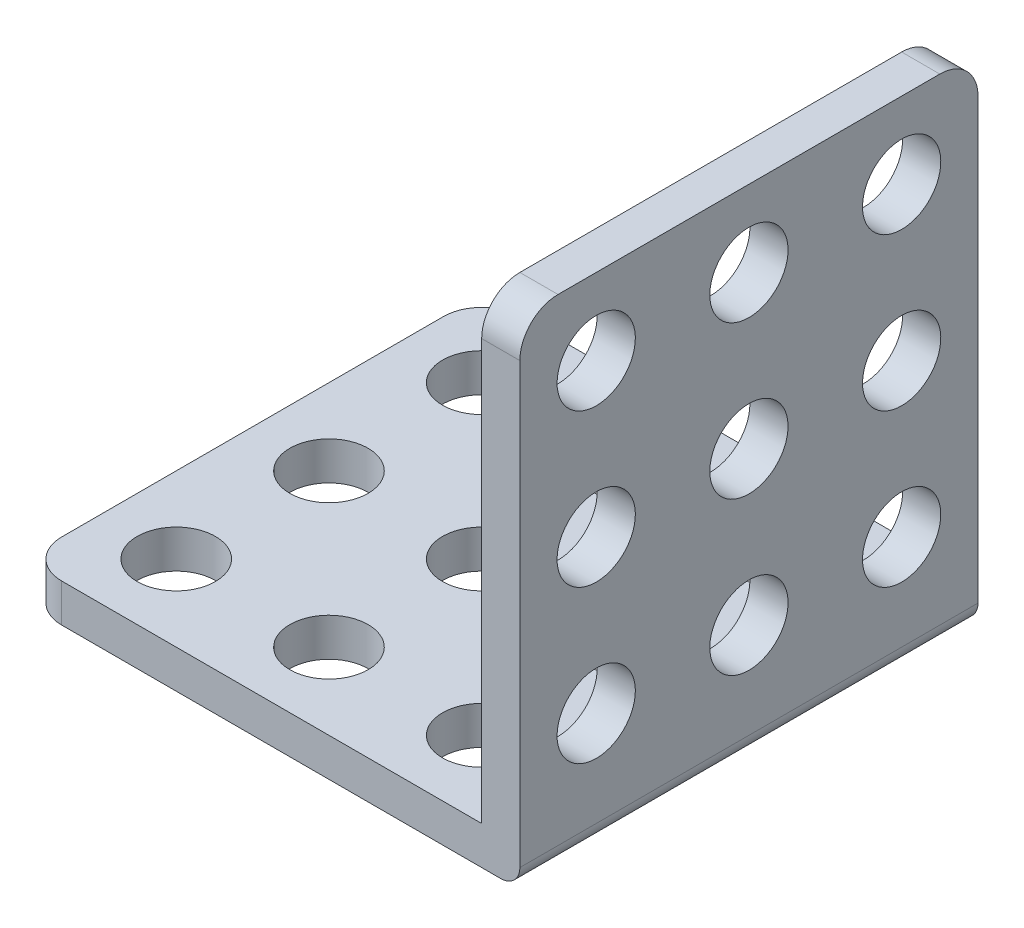
ISO-10303-21;
HEADER;
FILE_DESCRIPTION(('STEP AP214'),'2;1');
FILE_NAME('part.step','',(''),(''),'','','');
FILE_SCHEMA(('AUTOMOTIVE_DESIGN { 1 0 10303 214 1 1 1 1 }'));
ENDSEC;
DATA;
#1=APPLICATION_CONTEXT('core data for automotive mechanical design processes');
#2=APPLICATION_PROTOCOL_DEFINITION('international standard','automotive_design',2000,#1);
#3=PRODUCT_CONTEXT('',#1,'mechanical');
#4=PRODUCT('Part','Part','',(#3));
#5=PRODUCT_RELATED_PRODUCT_CATEGORY('part','',(#4));
#6=PRODUCT_DEFINITION_FORMATION('','',#4);
#7=PRODUCT_DEFINITION_CONTEXT('part definition',#1,'design');
#8=PRODUCT_DEFINITION('design','',#6,#7);
#9=PRODUCT_DEFINITION_SHAPE('','',#8);
#10=(LENGTH_UNIT() NAMED_UNIT(*) SI_UNIT(.MILLI.,.METRE.));
#11=(NAMED_UNIT(*) PLANE_ANGLE_UNIT() SI_UNIT($,.RADIAN.));
#12=(NAMED_UNIT(*) SI_UNIT($,.STERADIAN.) SOLID_ANGLE_UNIT());
#13=UNCERTAINTY_MEASURE_WITH_UNIT(LENGTH_MEASURE(1.E-05),#10,'distance_accuracy_value','');
#14=(GEOMETRIC_REPRESENTATION_CONTEXT(3) GLOBAL_UNCERTAINTY_ASSIGNED_CONTEXT((#13)) GLOBAL_UNIT_ASSIGNED_CONTEXT((#10,
#11,#12)) REPRESENTATION_CONTEXT('',''));
#15=CARTESIAN_POINT('',(0.,0.,0.));
#16=DIRECTION('',(0.,0.,1.));
#17=DIRECTION('',(1.,0.,0.));
#18=AXIS2_PLACEMENT_3D('',#15,#16,#17);
#19=CARTESIAN_POINT('',(2.,11.9999999999999,4.));
#20=DIRECTION('',(-1.,0.,0.));
#21=DIRECTION('',(0.,-1.,0.));
#22=AXIS2_PLACEMENT_3D('',#19,#20,#21);
#23=CYLINDRICAL_SURFACE('',#22,2.05);
#24=CARTESIAN_POINT('',(2.,11.9999999999999,4.));
#25=DIRECTION('',(-1.,0.,0.));
#26=DIRECTION('',(0.,-1.,0.));
#27=AXIS2_PLACEMENT_3D('',#24,#25,#26);
#28=CIRCLE('',#27,2.05);
#29=CARTESIAN_POINT('',(2.,9.9499999999999,4.));
#30=VERTEX_POINT('',#29);
#31=EDGE_CURVE('E145',#30,#30,#28,.F.);
#32=ORIENTED_EDGE('',*,*,#31,.T.);
#33=EDGE_LOOP('',(#32));
#34=FACE_BOUND('',#33,.T.);
#35=CARTESIAN_POINT('',(0.,11.9999999999999,4.));
#36=DIRECTION('',(-1.,0.,0.));
#37=DIRECTION('',(0.,-1.,0.));
#38=AXIS2_PLACEMENT_3D('',#35,#36,#37);
#39=CIRCLE('',#38,2.05);
#40=CARTESIAN_POINT('',(0.,9.9499999999999,4.));
#41=VERTEX_POINT('',#40);
#42=EDGE_CURVE('E20',#41,#41,#39,.T.);
#43=ORIENTED_EDGE('',*,*,#42,.T.);
#44=EDGE_LOOP('',(#43));
#45=FACE_BOUND('',#44,.T.);
#46=ADVANCED_FACE('F17',(#34,#45),#23,.F.);
#47=CARTESIAN_POINT('',(2.,19.9999999999999,4.));
#48=DIRECTION('',(-1.,0.,0.));
#49=DIRECTION('',(0.,-1.,0.));
#50=AXIS2_PLACEMENT_3D('',#47,#48,#49);
#51=CYLINDRICAL_SURFACE('',#50,2.05);
#52=CARTESIAN_POINT('',(2.,19.9999999999999,4.));
#53=DIRECTION('',(-1.,0.,0.));
#54=DIRECTION('',(0.,-1.,0.));
#55=AXIS2_PLACEMENT_3D('',#52,#53,#54);
#56=CIRCLE('',#55,2.05);
#57=CARTESIAN_POINT('',(2.,17.9499999999999,4.));
#58=VERTEX_POINT('',#57);
#59=EDGE_CURVE('E241',#58,#58,#56,.F.);
#60=ORIENTED_EDGE('',*,*,#59,.T.);
#61=EDGE_LOOP('',(#60));
#62=FACE_BOUND('',#61,.T.);
#63=CARTESIAN_POINT('',(0.,19.9999999999999,4.));
#64=DIRECTION('',(-1.,0.,0.));
#65=DIRECTION('',(0.,-1.,0.));
#66=AXIS2_PLACEMENT_3D('',#63,#64,#65);
#67=CIRCLE('',#66,2.05);
#68=CARTESIAN_POINT('',(0.,17.9499999999999,4.));
#69=VERTEX_POINT('',#68);
#70=EDGE_CURVE('E263',#69,#69,#67,.T.);
#71=ORIENTED_EDGE('',*,*,#70,.T.);
#72=EDGE_LOOP('',(#71));
#73=FACE_BOUND('',#72,.T.);
#74=ADVANCED_FACE('F380',(#62,#73),#51,.F.);
#75=CARTESIAN_POINT('',(2.,3.9999999999999,4.));
#76=DIRECTION('',(-1.,0.,0.));
#77=DIRECTION('',(0.,-1.,0.));
#78=AXIS2_PLACEMENT_3D('',#75,#76,#77);
#79=CYLINDRICAL_SURFACE('',#78,2.05);
#80=CARTESIAN_POINT('',(2.,3.9999999999999,4.));
#81=DIRECTION('',(-1.,0.,0.));
#82=DIRECTION('',(0.,-1.,0.));
#83=AXIS2_PLACEMENT_3D('',#80,#81,#82);
#84=CIRCLE('',#83,2.05);
#85=CARTESIAN_POINT('',(2.,1.9499999999999,4.));
#86=VERTEX_POINT('',#85);
#87=EDGE_CURVE('E238',#86,#86,#84,.F.);
#88=ORIENTED_EDGE('',*,*,#87,.T.);
#89=EDGE_LOOP('',(#88));
#90=FACE_BOUND('',#89,.T.);
#91=CARTESIAN_POINT('',(0.,3.9999999999999,4.));
#92=DIRECTION('',(-1.,0.,0.));
#93=DIRECTION('',(0.,-1.,0.));
#94=AXIS2_PLACEMENT_3D('',#91,#92,#93);
#95=CIRCLE('',#94,2.05);
#96=CARTESIAN_POINT('',(0.,1.9499999999999,4.));
#97=VERTEX_POINT('',#96);
#98=EDGE_CURVE('E261',#97,#97,#95,.T.);
#99=ORIENTED_EDGE('',*,*,#98,.T.);
#100=EDGE_LOOP('',(#99));
#101=FACE_BOUND('',#100,.T.);
#102=ADVANCED_FACE('F383',(#90,#101),#79,.F.);
#103=CARTESIAN_POINT('',(2.,11.9999999999999,12.));
#104=DIRECTION('',(-1.,0.,0.));
#105=DIRECTION('',(0.,-1.,0.));
#106=AXIS2_PLACEMENT_3D('',#103,#104,#105);
#107=CYLINDRICAL_SURFACE('',#106,2.05);
#108=CARTESIAN_POINT('',(2.,11.9999999999999,12.));
#109=DIRECTION('',(-1.,0.,0.));
#110=DIRECTION('',(0.,-1.,0.));
#111=AXIS2_PLACEMENT_3D('',#108,#109,#110);
#112=CIRCLE('',#111,2.05);
#113=CARTESIAN_POINT('',(2.,9.94999999999995,12.));
#114=VERTEX_POINT('',#113);
#115=EDGE_CURVE('E235',#114,#114,#112,.F.);
#116=ORIENTED_EDGE('',*,*,#115,.T.);
#117=EDGE_LOOP('',(#116));
#118=FACE_BOUND('',#117,.T.);
#119=CARTESIAN_POINT('',(0.,11.9999999999999,12.));
#120=DIRECTION('',(-1.,0.,0.));
#121=DIRECTION('',(0.,-1.,0.));
#122=AXIS2_PLACEMENT_3D('',#119,#120,#121);
#123=CIRCLE('',#122,2.05);
#124=CARTESIAN_POINT('',(0.,9.94999999999995,12.));
#125=VERTEX_POINT('',#124);
#126=EDGE_CURVE('E258',#125,#125,#123,.T.);
#127=ORIENTED_EDGE('',*,*,#126,.T.);
#128=EDGE_LOOP('',(#127));
#129=FACE_BOUND('',#128,.T.);
#130=ADVANCED_FACE('F388',(#118,#129),#107,.F.);
#131=CARTESIAN_POINT('',(2.,12.,20.));
#132=DIRECTION('',(-1.,0.,0.));
#133=DIRECTION('',(0.,-1.,0.));
#134=AXIS2_PLACEMENT_3D('',#131,#132,#133);
#135=CYLINDRICAL_SURFACE('',#134,2.05);
#136=CARTESIAN_POINT('',(2.,12.,20.));
#137=DIRECTION('',(-1.,0.,0.));
#138=DIRECTION('',(0.,-1.,0.));
#139=AXIS2_PLACEMENT_3D('',#136,#137,#138);
#140=CIRCLE('',#139,2.05);
#141=CARTESIAN_POINT('',(2.,9.95,20.));
#142=VERTEX_POINT('',#141);
#143=EDGE_CURVE('E232',#142,#142,#140,.F.);
#144=ORIENTED_EDGE('',*,*,#143,.T.);
#145=EDGE_LOOP('',(#144));
#146=FACE_BOUND('',#145,.T.);
#147=CARTESIAN_POINT('',(0.,12.,20.));
#148=DIRECTION('',(-1.,0.,0.));
#149=DIRECTION('',(0.,-1.,0.));
#150=AXIS2_PLACEMENT_3D('',#147,#148,#149);
#151=CIRCLE('',#150,2.05);
#152=CARTESIAN_POINT('',(0.,9.95,20.));
#153=VERTEX_POINT('',#152);
#154=EDGE_CURVE('E255',#153,#153,#151,.T.);
#155=ORIENTED_EDGE('',*,*,#154,.T.);
#156=EDGE_LOOP('',(#155));
#157=FACE_BOUND('',#156,.T.);
#158=ADVANCED_FACE('F394',(#146,#157),#135,.F.);
#159=CARTESIAN_POINT('',(2.,19.9999999999999,12.));
#160=DIRECTION('',(-1.,0.,0.));
#161=DIRECTION('',(0.,-1.,0.));
#162=AXIS2_PLACEMENT_3D('',#159,#160,#161);
#163=CYLINDRICAL_SURFACE('',#162,2.05);
#164=CARTESIAN_POINT('',(2.,19.9999999999999,12.));
#165=DIRECTION('',(-1.,0.,0.));
#166=DIRECTION('',(0.,-1.,0.));
#167=AXIS2_PLACEMENT_3D('',#164,#165,#166);
#168=CIRCLE('',#167,2.05);
#169=CARTESIAN_POINT('',(2.,17.9499999999999,12.));
#170=VERTEX_POINT('',#169);
#171=EDGE_CURVE('E229',#170,#170,#168,.F.);
#172=ORIENTED_EDGE('',*,*,#171,.T.);
#173=EDGE_LOOP('',(#172));
#174=FACE_BOUND('',#173,.T.);
#175=CARTESIAN_POINT('',(0.,19.9999999999999,12.));
#176=DIRECTION('',(-1.,0.,0.));
#177=DIRECTION('',(0.,-1.,0.));
#178=AXIS2_PLACEMENT_3D('',#175,#176,#177);
#179=CIRCLE('',#178,2.05);
#180=CARTESIAN_POINT('',(0.,17.9499999999999,12.));
#181=VERTEX_POINT('',#180);
#182=EDGE_CURVE('E252',#181,#181,#179,.T.);
#183=ORIENTED_EDGE('',*,*,#182,.T.);
#184=EDGE_LOOP('',(#183));
#185=FACE_BOUND('',#184,.T.);
#186=ADVANCED_FACE('F398',(#174,#185),#163,.F.);
#187=CARTESIAN_POINT('',(2.,20.,20.));
#188=DIRECTION('',(-1.,0.,0.));
#189=DIRECTION('',(0.,-1.,0.));
#190=AXIS2_PLACEMENT_3D('',#187,#188,#189);
#191=CYLINDRICAL_SURFACE('',#190,2.05);
#192=CARTESIAN_POINT('',(2.,20.,20.));
#193=DIRECTION('',(-1.,0.,0.));
#194=DIRECTION('',(0.,-1.,0.));
#195=AXIS2_PLACEMENT_3D('',#192,#193,#194);
#196=CIRCLE('',#195,2.05);
#197=CARTESIAN_POINT('',(2.,17.95,20.));
#198=VERTEX_POINT('',#197);
#199=EDGE_CURVE('E226',#198,#198,#196,.F.);
#200=ORIENTED_EDGE('',*,*,#199,.T.);
#201=EDGE_LOOP('',(#200));
#202=FACE_BOUND('',#201,.T.);
#203=CARTESIAN_POINT('',(0.,20.,20.));
#204=DIRECTION('',(-1.,0.,0.));
#205=DIRECTION('',(0.,-1.,0.));
#206=AXIS2_PLACEMENT_3D('',#203,#204,#205);
#207=CIRCLE('',#206,2.05);
#208=CARTESIAN_POINT('',(0.,17.95,20.));
#209=VERTEX_POINT('',#208);
#210=EDGE_CURVE('E249',#209,#209,#207,.T.);
#211=ORIENTED_EDGE('',*,*,#210,.T.);
#212=EDGE_LOOP('',(#211));
#213=FACE_BOUND('',#212,.T.);
#214=ADVANCED_FACE('F402',(#202,#213),#191,.F.);
#215=CARTESIAN_POINT('',(2.,4.,20.));
#216=DIRECTION('',(-1.,0.,0.));
#217=DIRECTION('',(0.,-1.,0.));
#218=AXIS2_PLACEMENT_3D('',#215,#216,#217);
#219=CYLINDRICAL_SURFACE('',#218,2.05);
#220=CARTESIAN_POINT('',(2.,4.,20.));
#221=DIRECTION('',(-1.,0.,0.));
#222=DIRECTION('',(0.,-1.,0.));
#223=AXIS2_PLACEMENT_3D('',#220,#221,#222);
#224=CIRCLE('',#223,2.05);
#225=CARTESIAN_POINT('',(2.,1.95,20.));
#226=VERTEX_POINT('',#225);
#227=EDGE_CURVE('E223',#226,#226,#224,.F.);
#228=ORIENTED_EDGE('',*,*,#227,.T.);
#229=EDGE_LOOP('',(#228));
#230=FACE_BOUND('',#229,.T.);
#231=CARTESIAN_POINT('',(0.,4.,20.));
#232=DIRECTION('',(-1.,0.,0.));
#233=DIRECTION('',(0.,-1.,0.));
#234=AXIS2_PLACEMENT_3D('',#231,#232,#233);
#235=CIRCLE('',#234,2.05);
#236=CARTESIAN_POINT('',(0.,1.95,20.));
#237=VERTEX_POINT('',#236);
#238=EDGE_CURVE('E124',#237,#237,#235,.T.);
#239=ORIENTED_EDGE('',*,*,#238,.T.);
#240=EDGE_LOOP('',(#239));
#241=FACE_BOUND('',#240,.T.);
#242=ADVANCED_FACE('F406',(#230,#241),#219,.F.);
#243=CARTESIAN_POINT('',(2.,3.99999999999995,12.));
#244=DIRECTION('',(-1.,0.,0.));
#245=DIRECTION('',(0.,-1.,0.));
#246=AXIS2_PLACEMENT_3D('',#243,#244,#245);
#247=CYLINDRICAL_SURFACE('',#246,2.05);
#248=CARTESIAN_POINT('',(2.,3.99999999999995,12.));
#249=DIRECTION('',(-1.,0.,0.));
#250=DIRECTION('',(0.,-1.,0.));
#251=AXIS2_PLACEMENT_3D('',#248,#249,#250);
#252=CIRCLE('',#251,2.05);
#253=CARTESIAN_POINT('',(2.,1.94999999999995,12.));
#254=VERTEX_POINT('',#253);
#255=EDGE_CURVE('E220',#254,#254,#252,.F.);
#256=ORIENTED_EDGE('',*,*,#255,.T.);
#257=EDGE_LOOP('',(#256));
#258=FACE_BOUND('',#257,.T.);
#259=CARTESIAN_POINT('',(0.,3.99999999999995,12.));
#260=DIRECTION('',(-1.,0.,0.));
#261=DIRECTION('',(0.,-1.,0.));
#262=AXIS2_PLACEMENT_3D('',#259,#260,#261);
#263=CIRCLE('',#262,2.05);
#264=CARTESIAN_POINT('',(0.,1.94999999999995,12.));
#265=VERTEX_POINT('',#264);
#266=EDGE_CURVE('E121',#265,#265,#263,.T.);
#267=ORIENTED_EDGE('',*,*,#266,.T.);
#268=EDGE_LOOP('',(#267));
#269=FACE_BOUND('',#268,.T.);
#270=ADVANCED_FACE('F410',(#258,#269),#247,.F.);
#271=CARTESIAN_POINT('',(0.,24.,24.));
#272=DIRECTION('',(0.,-1.,0.));
#273=DIRECTION('',(0.,0.,-1.));
#274=AXIS2_PLACEMENT_3D('',#271,#272,#273);
#275=PLANE('',#274);
#276=DIRECTION('',(-1.,0.,0.));
#277=VECTOR('',#276,1.);
#278=CARTESIAN_POINT('',(-24.,24.,22.));
#279=LINE('',#278,#277);
#280=CARTESIAN_POINT('',(2.,24.,22.));
#281=VERTEX_POINT('',#280);
#282=CARTESIAN_POINT('',(0.,24.,22.));
#283=VERTEX_POINT('',#282);
#284=EDGE_CURVE('E94',#281,#283,#279,.T.);
#285=ORIENTED_EDGE('',*,*,#284,.F.);
#286=DIRECTION('',(0.,0.,1.));
#287=VECTOR('',#286,1.);
#288=CARTESIAN_POINT('',(2.,24.,24.));
#289=LINE('',#288,#287);
#290=CARTESIAN_POINT('',(2.,24.,2.));
#291=VERTEX_POINT('',#290);
#292=EDGE_CURVE('E133',#281,#291,#289,.F.);
#293=ORIENTED_EDGE('',*,*,#292,.T.);
#294=DIRECTION('',(1.,0.,0.));
#295=VECTOR('',#294,1.);
#296=CARTESIAN_POINT('',(0.,24.,2.));
#297=LINE('',#296,#295);
#298=CARTESIAN_POINT('',(0.,24.,2.));
#299=VERTEX_POINT('',#298);
#300=EDGE_CURVE('E120',#299,#291,#297,.T.);
#301=ORIENTED_EDGE('',*,*,#300,.F.);
#302=DIRECTION('',(0.,0.,1.));
#303=VECTOR('',#302,1.);
#304=CARTESIAN_POINT('',(0.,24.,24.));
#305=LINE('',#304,#303);
#306=EDGE_CURVE('E111',#299,#283,#305,.T.);
#307=ORIENTED_EDGE('',*,*,#306,.T.);
#308=EDGE_LOOP('',(#285,#293,#301,#307));
#309=FACE_BOUND('',#308,.T.);
#310=ADVANCED_FACE('F119',(#309),#275,.F.);
#311=CARTESIAN_POINT('',(-24.,22.,22.));
#312=DIRECTION('',(-1.,0.,0.));
#313=DIRECTION('',(0.,0.,1.));
#314=AXIS2_PLACEMENT_3D('',#311,#312,#313);
#315=CYLINDRICAL_SURFACE('',#314,2.);
#316=CARTESIAN_POINT('',(0.,22.,22.));
#317=DIRECTION('',(-1.,0.,0.));
#318=DIRECTION('',(0.,0.,1.));
#319=AXIS2_PLACEMENT_3D('',#316,#317,#318);
#320=CIRCLE('',#319,2.);
#321=CARTESIAN_POINT('',(0.,22.,24.));
#322=VERTEX_POINT('',#321);
#323=EDGE_CURVE('E98',#283,#322,#320,.F.);
#324=ORIENTED_EDGE('',*,*,#323,.T.);
#325=DIRECTION('',(-1.,0.,0.));
#326=VECTOR('',#325,1.);
#327=CARTESIAN_POINT('',(-24.,22.,24.));
#328=LINE('',#327,#326);
#329=CARTESIAN_POINT('',(2.,22.,24.));
#330=VERTEX_POINT('',#329);
#331=EDGE_CURVE('E140',#322,#330,#328,.F.);
#332=ORIENTED_EDGE('',*,*,#331,.T.);
#333=CARTESIAN_POINT('',(2.,22.,22.));
#334=DIRECTION('',(-1.,0.,0.));
#335=DIRECTION('',(0.,0.,1.));
#336=AXIS2_PLACEMENT_3D('',#333,#334,#335);
#337=CIRCLE('',#336,2.);
#338=EDGE_CURVE('E100',#330,#281,#337,.T.);
#339=ORIENTED_EDGE('',*,*,#338,.T.);
#340=ORIENTED_EDGE('',*,*,#284,.T.);
#341=EDGE_LOOP('',(#324,#332,#339,#340));
#342=FACE_BOUND('',#341,.T.);
#343=ADVANCED_FACE('F96',(#342),#315,.T.);
#344=CARTESIAN_POINT('',(0.,0.,24.));
#345=DIRECTION('',(1.,0.,0.));
#346=DIRECTION('',(0.,1.,0.));
#347=AXIS2_PLACEMENT_3D('',#344,#345,#346);
#348=PLANE('',#347);
#349=ORIENTED_EDGE('',*,*,#323,.F.);
#350=ORIENTED_EDGE('',*,*,#306,.F.);
#351=CARTESIAN_POINT('',(0.,22.,2.));
#352=DIRECTION('',(1.,0.,0.));
#353=DIRECTION('',(0.,0.,-1.));
#354=AXIS2_PLACEMENT_3D('',#351,#352,#353);
#355=CIRCLE('',#354,2.);
#356=CARTESIAN_POINT('',(0.,22.,0.));
#357=VERTEX_POINT('',#356);
#358=EDGE_CURVE('E116',#357,#299,#355,.T.);
#359=ORIENTED_EDGE('',*,*,#358,.F.);
#360=DIRECTION('',(0.,1.,0.));
#361=VECTOR('',#360,1.);
#362=CARTESIAN_POINT('',(0.,0.,0.));
#363=LINE('',#362,#361);
#364=CARTESIAN_POINT('',(0.,0.,0.));
#365=VERTEX_POINT('',#364);
#366=EDGE_CURVE('E128',#365,#357,#363,.T.);
#367=ORIENTED_EDGE('',*,*,#366,.F.);
#368=DIRECTION('',(0.,0.,-1.));
#369=VECTOR('',#368,1.);
#370=CARTESIAN_POINT('',(0.,0.,24.));
#371=LINE('',#370,#369);
#372=CARTESIAN_POINT('',(0.,0.,24.));
#373=VERTEX_POINT('',#372);
#374=EDGE_CURVE('E130',#365,#373,#371,.F.);
#375=ORIENTED_EDGE('',*,*,#374,.T.);
#376=DIRECTION('',(0.,1.,0.));
#377=VECTOR('',#376,1.);
#378=CARTESIAN_POINT('',(0.,0.,24.));
#379=LINE('',#378,#377);
#380=EDGE_CURVE('E115',#373,#322,#379,.T.);
#381=ORIENTED_EDGE('',*,*,#380,.T.);
#382=EDGE_LOOP('',(#349,#350,#359,#367,#375,#381));
#383=FACE_BOUND('',#382,.T.);
#384=ORIENTED_EDGE('',*,*,#266,.F.);
#385=EDGE_LOOP('',(#384));
#386=FACE_BOUND('',#385,.T.);
#387=ORIENTED_EDGE('',*,*,#238,.F.);
#388=EDGE_LOOP('',(#387));
#389=FACE_BOUND('',#388,.T.);
#390=ORIENTED_EDGE('',*,*,#210,.F.);
#391=EDGE_LOOP('',(#390));
#392=FACE_BOUND('',#391,.T.);
#393=ORIENTED_EDGE('',*,*,#182,.F.);
#394=EDGE_LOOP('',(#393));
#395=FACE_BOUND('',#394,.T.);
#396=ORIENTED_EDGE('',*,*,#154,.F.);
#397=EDGE_LOOP('',(#396));
#398=FACE_BOUND('',#397,.T.);
#399=ORIENTED_EDGE('',*,*,#126,.F.);
#400=EDGE_LOOP('',(#399));
#401=FACE_BOUND('',#400,.T.);
#402=ORIENTED_EDGE('',*,*,#98,.F.);
#403=EDGE_LOOP('',(#402));
#404=FACE_BOUND('',#403,.T.);
#405=ORIENTED_EDGE('',*,*,#70,.F.);
#406=EDGE_LOOP('',(#405));
#407=FACE_BOUND('',#406,.T.);
#408=ORIENTED_EDGE('',*,*,#42,.F.);
#409=EDGE_LOOP('',(#408));
#410=FACE_BOUND('',#409,.T.);
#411=ADVANCED_FACE('F108',(#383,#386,#389,#392,#395,#398,#401,#404,#407,#410),#348,.F.);
#412=CARTESIAN_POINT('',(0.,22.,2.));
#413=DIRECTION('',(1.,0.,0.));
#414=DIRECTION('',(0.,0.,-1.));
#415=AXIS2_PLACEMENT_3D('',#412,#413,#414);
#416=CYLINDRICAL_SURFACE('',#415,2.);
#417=ORIENTED_EDGE('',*,*,#358,.T.);
#418=ORIENTED_EDGE('',*,*,#300,.T.);
#419=CARTESIAN_POINT('',(2.,22.,2.));
#420=DIRECTION('',(1.,0.,0.));
#421=DIRECTION('',(0.,0.,-1.));
#422=AXIS2_PLACEMENT_3D('',#419,#420,#421);
#423=CIRCLE('',#422,2.);
#424=CARTESIAN_POINT('',(2.,22.,0.));
#425=VERTEX_POINT('',#424);
#426=EDGE_CURVE('E217',#291,#425,#423,.F.);
#427=ORIENTED_EDGE('',*,*,#426,.T.);
#428=DIRECTION('',(-1.,0.,0.));
#429=VECTOR('',#428,1.);
#430=CARTESIAN_POINT('',(-24.,22.,0.));
#431=LINE('',#430,#429);
#432=EDGE_CURVE('E642',#357,#425,#431,.F.);
#433=ORIENTED_EDGE('',*,*,#432,.F.);
#434=EDGE_LOOP('',(#417,#418,#427,#433));
#435=FACE_BOUND('',#434,.T.);
#436=ADVANCED_FACE('F272',(#435),#416,.T.);
#437=CARTESIAN_POINT('',(2.,24.,24.));
#438=DIRECTION('',(-1.,0.,0.));
#439=DIRECTION('',(0.,-1.,0.));
#440=AXIS2_PLACEMENT_3D('',#437,#438,#439);
#441=PLANE('',#440);
#442=ORIENTED_EDGE('',*,*,#338,.F.);
#443=DIRECTION('',(0.,1.,0.));
#444=VECTOR('',#443,1.);
#445=CARTESIAN_POINT('',(2.,0.,24.));
#446=LINE('',#445,#444);
#447=CARTESIAN_POINT('',(2.,-0.999999999999997,24.));
#448=VERTEX_POINT('',#447);
#449=EDGE_CURVE('E142',#330,#448,#446,.F.);
#450=ORIENTED_EDGE('',*,*,#449,.T.);
#451=DIRECTION('',(0.,0.,-1.));
#452=VECTOR('',#451,1.);
#453=CARTESIAN_POINT('',(2.,-0.999999999999997,24.));
#454=LINE('',#453,#452);
#455=CARTESIAN_POINT('',(2.,-0.999999999999997,0.));
#456=VERTEX_POINT('',#455);
#457=EDGE_CURVE('E188',#456,#448,#454,.F.);
#458=ORIENTED_EDGE('',*,*,#457,.F.);
#459=DIRECTION('',(0.,1.,0.));
#460=VECTOR('',#459,1.);
#461=CARTESIAN_POINT('',(2.,0.,0.));
#462=LINE('',#461,#460);
#463=EDGE_CURVE('E186',#425,#456,#462,.F.);
#464=ORIENTED_EDGE('',*,*,#463,.F.);
#465=ORIENTED_EDGE('',*,*,#426,.F.);
#466=ORIENTED_EDGE('',*,*,#292,.F.);
#467=EDGE_LOOP('',(#442,#450,#458,#464,#465,#466));
#468=FACE_BOUND('',#467,.T.);
#469=ORIENTED_EDGE('',*,*,#255,.F.);
#470=EDGE_LOOP('',(#469));
#471=FACE_BOUND('',#470,.T.);
#472=ORIENTED_EDGE('',*,*,#227,.F.);
#473=EDGE_LOOP('',(#472));
#474=FACE_BOUND('',#473,.T.);
#475=ORIENTED_EDGE('',*,*,#199,.F.);
#476=EDGE_LOOP('',(#475));
#477=FACE_BOUND('',#476,.T.);
#478=ORIENTED_EDGE('',*,*,#171,.F.);
#479=EDGE_LOOP('',(#478));
#480=FACE_BOUND('',#479,.T.);
#481=ORIENTED_EDGE('',*,*,#143,.F.);
#482=EDGE_LOOP('',(#481));
#483=FACE_BOUND('',#482,.T.);
#484=ORIENTED_EDGE('',*,*,#115,.F.);
#485=EDGE_LOOP('',(#484));
#486=FACE_BOUND('',#485,.T.);
#487=ORIENTED_EDGE('',*,*,#87,.F.);
#488=EDGE_LOOP('',(#487));
#489=FACE_BOUND('',#488,.T.);
#490=ORIENTED_EDGE('',*,*,#59,.F.);
#491=EDGE_LOOP('',(#490));
#492=FACE_BOUND('',#491,.T.);
#493=ORIENTED_EDGE('',*,*,#31,.F.);
#494=EDGE_LOOP('',(#493));
#495=FACE_BOUND('',#494,.T.);
#496=ADVANCED_FACE('F279',(#468,#471,#474,#477,#480,#483,#486,#489,#492,#495),#441,.F.);
#497=CARTESIAN_POINT('',(-24.,0.,24.));
#498=DIRECTION('',(0.,-1.,0.));
#499=DIRECTION('',(0.,0.,-1.));
#500=AXIS2_PLACEMENT_3D('',#497,#498,#499);
#501=PLANE('',#500);
#502=CARTESIAN_POINT('',(-22.,0.,2.));
#503=DIRECTION('',(0.,1.,0.));
#504=DIRECTION('',(0.,0.,1.));
#505=AXIS2_PLACEMENT_3D('',#502,#503,#504);
#506=CIRCLE('',#505,2.);
#507=CARTESIAN_POINT('',(-24.,0.,2.));
#508=VERTEX_POINT('',#507);
#509=CARTESIAN_POINT('',(-22.,0.,0.));
#510=VERTEX_POINT('',#509);
#511=EDGE_CURVE('E181',#508,#510,#506,.F.);
#512=ORIENTED_EDGE('',*,*,#511,.F.);
#513=DIRECTION('',(0.,0.,-1.));
#514=VECTOR('',#513,1.);
#515=CARTESIAN_POINT('',(-24.,0.,24.));
#516=LINE('',#515,#514);
#517=CARTESIAN_POINT('',(-24.,0.,22.));
#518=VERTEX_POINT('',#517);
#519=EDGE_CURVE('E180',#508,#518,#516,.F.);
#520=ORIENTED_EDGE('',*,*,#519,.T.);
#521=CARTESIAN_POINT('',(-22.,0.,22.));
#522=DIRECTION('',(0.,-1.,0.));
#523=DIRECTION('',(0.,0.,-1.));
#524=AXIS2_PLACEMENT_3D('',#521,#522,#523);
#525=CIRCLE('',#524,2.);
#526=CARTESIAN_POINT('',(-22.,0.,24.));
#527=VERTEX_POINT('',#526);
#528=EDGE_CURVE('E141',#527,#518,#525,.T.);
#529=ORIENTED_EDGE('',*,*,#528,.F.);
#530=DIRECTION('',(-1.,0.,0.));
#531=VECTOR('',#530,1.);
#532=CARTESIAN_POINT('',(-24.,0.,24.));
#533=LINE('',#532,#531);
#534=EDGE_CURVE('E134',#527,#373,#533,.F.);
#535=ORIENTED_EDGE('',*,*,#534,.T.);
#536=ORIENTED_EDGE('',*,*,#374,.F.);
#537=DIRECTION('',(-1.,0.,0.));
#538=VECTOR('',#537,1.);
#539=CARTESIAN_POINT('',(-24.,0.,0.));
#540=LINE('',#539,#538);
#541=EDGE_CURVE('E638',#510,#365,#540,.F.);
#542=ORIENTED_EDGE('',*,*,#541,.F.);
#543=EDGE_LOOP('',(#512,#520,#529,#535,#536,#542));
#544=FACE_BOUND('',#543,.T.);
#545=CARTESIAN_POINT('',(-19.9999999999999,0.,12.));
#546=DIRECTION('',(0.,1.,0.));
#547=DIRECTION('',(0.,0.,1.));
#548=AXIS2_PLACEMENT_3D('',#545,#546,#547);
#549=CIRCLE('',#548,2.05);
#550=CARTESIAN_POINT('',(-19.9999999999999,0.,14.05));
#551=VERTEX_POINT('',#550);
#552=EDGE_CURVE('E190',#551,#551,#549,.F.);
#553=ORIENTED_EDGE('',*,*,#552,.T.);
#554=EDGE_LOOP('',(#553));
#555=FACE_BOUND('',#554,.T.);
#556=CARTESIAN_POINT('',(-20.,0.,4.));
#557=DIRECTION('',(0.,1.,0.));
#558=DIRECTION('',(0.,0.,1.));
#559=AXIS2_PLACEMENT_3D('',#556,#557,#558);
#560=CIRCLE('',#559,2.05);
#561=CARTESIAN_POINT('',(-20.,0.,6.05));
#562=VERTEX_POINT('',#561);
#563=EDGE_CURVE('E193',#562,#562,#560,.F.);
#564=ORIENTED_EDGE('',*,*,#563,.T.);
#565=EDGE_LOOP('',(#564));
#566=FACE_BOUND('',#565,.T.);
#567=CARTESIAN_POINT('',(-4.,0.,4.));
#568=DIRECTION('',(0.,1.,0.));
#569=DIRECTION('',(0.,0.,1.));
#570=AXIS2_PLACEMENT_3D('',#567,#568,#569);
#571=CIRCLE('',#570,2.05);
#572=CARTESIAN_POINT('',(-4.,0.,6.05));
#573=VERTEX_POINT('',#572);
#574=EDGE_CURVE('E196',#573,#573,#571,.F.);
#575=ORIENTED_EDGE('',*,*,#574,.T.);
#576=EDGE_LOOP('',(#575));
#577=FACE_BOUND('',#576,.T.);
#578=CARTESIAN_POINT('',(-12.,0.,4.));
#579=DIRECTION('',(0.,1.,0.));
#580=DIRECTION('',(0.,0.,1.));
#581=AXIS2_PLACEMENT_3D('',#578,#579,#580);
#582=CIRCLE('',#581,2.05);
#583=CARTESIAN_POINT('',(-12.,0.,6.05));
#584=VERTEX_POINT('',#583);
#585=EDGE_CURVE('E199',#584,#584,#582,.F.);
#586=ORIENTED_EDGE('',*,*,#585,.T.);
#587=EDGE_LOOP('',(#586));
#588=FACE_BOUND('',#587,.T.);
#589=CARTESIAN_POINT('',(-3.99999999999991,0.,12.));
#590=DIRECTION('',(0.,1.,0.));
#591=DIRECTION('',(0.,0.,1.));
#592=AXIS2_PLACEMENT_3D('',#589,#590,#591);
#593=CIRCLE('',#592,2.05);
#594=CARTESIAN_POINT('',(-3.99999999999991,0.,14.05));
#595=VERTEX_POINT('',#594);
#596=EDGE_CURVE('E202',#595,#595,#593,.F.);
#597=ORIENTED_EDGE('',*,*,#596,.T.);
#598=EDGE_LOOP('',(#597));
#599=FACE_BOUND('',#598,.T.);
#600=CARTESIAN_POINT('',(-11.9999999999999,0.,12.));
#601=DIRECTION('',(0.,1.,0.));
#602=DIRECTION('',(0.,0.,1.));
#603=AXIS2_PLACEMENT_3D('',#600,#601,#602);
#604=CIRCLE('',#603,2.05);
#605=CARTESIAN_POINT('',(-11.9999999999999,0.,14.05));
#606=VERTEX_POINT('',#605);
#607=EDGE_CURVE('E205',#606,#606,#604,.F.);
#608=ORIENTED_EDGE('',*,*,#607,.T.);
#609=EDGE_LOOP('',(#608));
#610=FACE_BOUND('',#609,.T.);
#611=CARTESIAN_POINT('',(-19.9999999999998,0.,20.));
#612=DIRECTION('',(0.,1.,0.));
#613=DIRECTION('',(0.,0.,1.));
#614=AXIS2_PLACEMENT_3D('',#611,#612,#613);
#615=CIRCLE('',#614,2.05);
#616=CARTESIAN_POINT('',(-19.9999999999998,0.,22.05));
#617=VERTEX_POINT('',#616);
#618=EDGE_CURVE('E208',#617,#617,#615,.F.);
#619=ORIENTED_EDGE('',*,*,#618,.T.);
#620=EDGE_LOOP('',(#619));
#621=FACE_BOUND('',#620,.T.);
#622=CARTESIAN_POINT('',(-3.99999999999983,0.,20.));
#623=DIRECTION('',(0.,1.,0.));
#624=DIRECTION('',(0.,0.,1.));
#625=AXIS2_PLACEMENT_3D('',#622,#623,#624);
#626=CIRCLE('',#625,2.05);
#627=CARTESIAN_POINT('',(-3.99999999999983,0.,22.05));
#628=VERTEX_POINT('',#627);
#629=EDGE_CURVE('E211',#628,#628,#626,.F.);
#630=ORIENTED_EDGE('',*,*,#629,.T.);
#631=EDGE_LOOP('',(#630));
#632=FACE_BOUND('',#631,.T.);
#633=CARTESIAN_POINT('',(-11.9999999999998,0.,20.));
#634=DIRECTION('',(0.,1.,0.));
#635=DIRECTION('',(0.,0.,1.));
#636=AXIS2_PLACEMENT_3D('',#633,#634,#635);
#637=CIRCLE('',#636,2.05);
#638=CARTESIAN_POINT('',(-11.9999999999998,0.,22.05));
#639=VERTEX_POINT('',#638);
#640=EDGE_CURVE('E132',#639,#639,#637,.F.);
#641=ORIENTED_EDGE('',*,*,#640,.T.);
#642=EDGE_LOOP('',(#641));
#643=FACE_BOUND('',#642,.T.);
#644=ADVANCED_FACE('F350',(#544,#555,#566,#577,#588,#599,#610,#621,#632,#643),#501,.F.);
#645=CARTESIAN_POINT('',(-11.9999999999998,-2.,20.));
#646=DIRECTION('',(0.,1.,0.));
#647=DIRECTION('',(0.,0.,1.));
#648=AXIS2_PLACEMENT_3D('',#645,#646,#647);
#649=CYLINDRICAL_SURFACE('',#648,2.05);
#650=CARTESIAN_POINT('',(-11.9999999999998,-2.,20.));
#651=DIRECTION('',(0.,1.,0.));
#652=DIRECTION('',(0.,0.,1.));
#653=AXIS2_PLACEMENT_3D('',#650,#651,#652);
#654=CIRCLE('',#653,2.05);
#655=CARTESIAN_POINT('',(-11.9999999999998,-2.,22.05));
#656=VERTEX_POINT('',#655);
#657=EDGE_CURVE('E177',#656,#656,#654,.F.);
#658=ORIENTED_EDGE('',*,*,#657,.T.);
#659=EDGE_LOOP('',(#658));
#660=FACE_BOUND('',#659,.T.);
#661=ORIENTED_EDGE('',*,*,#640,.F.);
#662=EDGE_LOOP('',(#661));
#663=FACE_BOUND('',#662,.T.);
#664=ADVANCED_FACE('F346',(#660,#663),#649,.F.);
#665=CARTESIAN_POINT('',(-3.99999999999983,-2.,20.));
#666=DIRECTION('',(0.,1.,0.));
#667=DIRECTION('',(0.,0.,1.));
#668=AXIS2_PLACEMENT_3D('',#665,#666,#667);
#669=CYLINDRICAL_SURFACE('',#668,2.05);
#670=CARTESIAN_POINT('',(-3.99999999999983,-2.,20.));
#671=DIRECTION('',(0.,1.,0.));
#672=DIRECTION('',(0.,0.,1.));
#673=AXIS2_PLACEMENT_3D('',#670,#671,#672);
#674=CIRCLE('',#673,2.05);
#675=CARTESIAN_POINT('',(-3.99999999999983,-2.,22.05));
#676=VERTEX_POINT('',#675);
#677=EDGE_CURVE('E174',#676,#676,#674,.F.);
#678=ORIENTED_EDGE('',*,*,#677,.T.);
#679=EDGE_LOOP('',(#678));
#680=FACE_BOUND('',#679,.T.);
#681=ORIENTED_EDGE('',*,*,#629,.F.);
#682=EDGE_LOOP('',(#681));
#683=FACE_BOUND('',#682,.T.);
#684=ADVANCED_FACE('F342',(#680,#683),#669,.F.);
#685=CARTESIAN_POINT('',(-19.9999999999998,-2.,20.));
#686=DIRECTION('',(0.,1.,0.));
#687=DIRECTION('',(0.,0.,1.));
#688=AXIS2_PLACEMENT_3D('',#685,#686,#687);
#689=CYLINDRICAL_SURFACE('',#688,2.05);
#690=CARTESIAN_POINT('',(-19.9999999999998,-2.,20.));
#691=DIRECTION('',(0.,1.,0.));
#692=DIRECTION('',(0.,0.,1.));
#693=AXIS2_PLACEMENT_3D('',#690,#691,#692);
#694=CIRCLE('',#693,2.05);
#695=CARTESIAN_POINT('',(-19.9999999999998,-2.,22.05));
#696=VERTEX_POINT('',#695);
#697=EDGE_CURVE('E171',#696,#696,#694,.F.);
#698=ORIENTED_EDGE('',*,*,#697,.T.);
#699=EDGE_LOOP('',(#698));
#700=FACE_BOUND('',#699,.T.);
#701=ORIENTED_EDGE('',*,*,#618,.F.);
#702=EDGE_LOOP('',(#701));
#703=FACE_BOUND('',#702,.T.);
#704=ADVANCED_FACE('F338',(#700,#703),#689,.F.);
#705=CARTESIAN_POINT('',(-11.9999999999999,-2.,12.));
#706=DIRECTION('',(0.,1.,0.));
#707=DIRECTION('',(0.,0.,1.));
#708=AXIS2_PLACEMENT_3D('',#705,#706,#707);
#709=CYLINDRICAL_SURFACE('',#708,2.05);
#710=CARTESIAN_POINT('',(-11.9999999999999,-2.,12.));
#711=DIRECTION('',(0.,1.,0.));
#712=DIRECTION('',(0.,0.,1.));
#713=AXIS2_PLACEMENT_3D('',#710,#711,#712);
#714=CIRCLE('',#713,2.05);
#715=CARTESIAN_POINT('',(-11.9999999999999,-2.,14.05));
#716=VERTEX_POINT('',#715);
#717=EDGE_CURVE('E168',#716,#716,#714,.F.);
#718=ORIENTED_EDGE('',*,*,#717,.T.);
#719=EDGE_LOOP('',(#718));
#720=FACE_BOUND('',#719,.T.);
#721=ORIENTED_EDGE('',*,*,#607,.F.);
#722=EDGE_LOOP('',(#721));
#723=FACE_BOUND('',#722,.T.);
#724=ADVANCED_FACE('F334',(#720,#723),#709,.F.);
#725=CARTESIAN_POINT('',(-3.99999999999991,-2.,12.));
#726=DIRECTION('',(0.,1.,0.));
#727=DIRECTION('',(0.,0.,1.));
#728=AXIS2_PLACEMENT_3D('',#725,#726,#727);
#729=CYLINDRICAL_SURFACE('',#728,2.05);
#730=CARTESIAN_POINT('',(-3.99999999999991,-2.,12.));
#731=DIRECTION('',(0.,1.,0.));
#732=DIRECTION('',(0.,0.,1.));
#733=AXIS2_PLACEMENT_3D('',#730,#731,#732);
#734=CIRCLE('',#733,2.05);
#735=CARTESIAN_POINT('',(-3.99999999999991,-2.,14.05));
#736=VERTEX_POINT('',#735);
#737=EDGE_CURVE('E165',#736,#736,#734,.F.);
#738=ORIENTED_EDGE('',*,*,#737,.T.);
#739=EDGE_LOOP('',(#738));
#740=FACE_BOUND('',#739,.T.);
#741=ORIENTED_EDGE('',*,*,#596,.F.);
#742=EDGE_LOOP('',(#741));
#743=FACE_BOUND('',#742,.T.);
#744=ADVANCED_FACE('F330',(#740,#743),#729,.F.);
#745=CARTESIAN_POINT('',(-12.,-2.,4.));
#746=DIRECTION('',(0.,1.,0.));
#747=DIRECTION('',(0.,0.,1.));
#748=AXIS2_PLACEMENT_3D('',#745,#746,#747);
#749=CYLINDRICAL_SURFACE('',#748,2.05);
#750=CARTESIAN_POINT('',(-12.,-2.,4.));
#751=DIRECTION('',(0.,1.,0.));
#752=DIRECTION('',(0.,0.,1.));
#753=AXIS2_PLACEMENT_3D('',#750,#751,#752);
#754=CIRCLE('',#753,2.05);
#755=CARTESIAN_POINT('',(-12.,-2.,6.05));
#756=VERTEX_POINT('',#755);
#757=EDGE_CURVE('E162',#756,#756,#754,.F.);
#758=ORIENTED_EDGE('',*,*,#757,.T.);
#759=EDGE_LOOP('',(#758));
#760=FACE_BOUND('',#759,.T.);
#761=ORIENTED_EDGE('',*,*,#585,.F.);
#762=EDGE_LOOP('',(#761));
#763=FACE_BOUND('',#762,.T.);
#764=ADVANCED_FACE('F326',(#760,#763),#749,.F.);
#765=CARTESIAN_POINT('',(-4.,-2.,4.));
#766=DIRECTION('',(0.,1.,0.));
#767=DIRECTION('',(0.,0.,1.));
#768=AXIS2_PLACEMENT_3D('',#765,#766,#767);
#769=CYLINDRICAL_SURFACE('',#768,2.05);
#770=CARTESIAN_POINT('',(-4.,-2.,4.));
#771=DIRECTION('',(0.,1.,0.));
#772=DIRECTION('',(0.,0.,1.));
#773=AXIS2_PLACEMENT_3D('',#770,#771,#772);
#774=CIRCLE('',#773,2.05);
#775=CARTESIAN_POINT('',(-4.,-2.,6.05));
#776=VERTEX_POINT('',#775);
#777=EDGE_CURVE('E159',#776,#776,#774,.F.);
#778=ORIENTED_EDGE('',*,*,#777,.T.);
#779=EDGE_LOOP('',(#778));
#780=FACE_BOUND('',#779,.T.);
#781=ORIENTED_EDGE('',*,*,#574,.F.);
#782=EDGE_LOOP('',(#781));
#783=FACE_BOUND('',#782,.T.);
#784=ADVANCED_FACE('F322',(#780,#783),#769,.F.);
#785=CARTESIAN_POINT('',(-20.,-2.,4.));
#786=DIRECTION('',(0.,1.,0.));
#787=DIRECTION('',(0.,0.,1.));
#788=AXIS2_PLACEMENT_3D('',#785,#786,#787);
#789=CYLINDRICAL_SURFACE('',#788,2.05);
#790=CARTESIAN_POINT('',(-20.,-2.,4.));
#791=DIRECTION('',(0.,1.,0.));
#792=DIRECTION('',(0.,0.,1.));
#793=AXIS2_PLACEMENT_3D('',#790,#791,#792);
#794=CIRCLE('',#793,2.05);
#795=CARTESIAN_POINT('',(-20.,-2.,6.05));
#796=VERTEX_POINT('',#795);
#797=EDGE_CURVE('E156',#796,#796,#794,.F.);
#798=ORIENTED_EDGE('',*,*,#797,.T.);
#799=EDGE_LOOP('',(#798));
#800=FACE_BOUND('',#799,.T.);
#801=ORIENTED_EDGE('',*,*,#563,.F.);
#802=EDGE_LOOP('',(#801));
#803=FACE_BOUND('',#802,.T.);
#804=ADVANCED_FACE('F318',(#800,#803),#789,.F.);
#805=CARTESIAN_POINT('',(-19.9999999999999,-2.,12.));
#806=DIRECTION('',(0.,1.,0.));
#807=DIRECTION('',(0.,0.,1.));
#808=AXIS2_PLACEMENT_3D('',#805,#806,#807);
#809=CYLINDRICAL_SURFACE('',#808,2.05);
#810=CARTESIAN_POINT('',(-19.9999999999999,-2.,12.));
#811=DIRECTION('',(0.,1.,0.));
#812=DIRECTION('',(0.,0.,1.));
#813=AXIS2_PLACEMENT_3D('',#810,#811,#812);
#814=CIRCLE('',#813,2.05);
#815=CARTESIAN_POINT('',(-19.9999999999999,-2.,14.05));
#816=VERTEX_POINT('',#815);
#817=EDGE_CURVE('E153',#816,#816,#814,.F.);
#818=ORIENTED_EDGE('',*,*,#817,.T.);
#819=EDGE_LOOP('',(#818));
#820=FACE_BOUND('',#819,.T.);
#821=ORIENTED_EDGE('',*,*,#552,.F.);
#822=EDGE_LOOP('',(#821));
#823=FACE_BOUND('',#822,.T.);
#824=ADVANCED_FACE('F314',(#820,#823),#809,.F.);
#825=CARTESIAN_POINT('',(-22.,0.,22.));
#826=DIRECTION('',(0.,-1.,0.));
#827=DIRECTION('',(0.,0.,-1.));
#828=AXIS2_PLACEMENT_3D('',#825,#826,#827);
#829=CYLINDRICAL_SURFACE('',#828,2.);
#830=CARTESIAN_POINT('',(-22.,-2.,22.));
#831=DIRECTION('',(0.,-1.,0.));
#832=DIRECTION('',(0.,0.,-1.));
#833=AXIS2_PLACEMENT_3D('',#830,#831,#832);
#834=CIRCLE('',#833,2.);
#835=CARTESIAN_POINT('',(-24.,-2.,22.));
#836=VERTEX_POINT('',#835);
#837=CARTESIAN_POINT('',(-22.,-2.,24.));
#838=VERTEX_POINT('',#837);
#839=EDGE_CURVE('E149',#836,#838,#834,.F.);
#840=ORIENTED_EDGE('',*,*,#839,.T.);
#841=DIRECTION('',(0.,1.,0.));
#842=VECTOR('',#841,1.);
#843=CARTESIAN_POINT('',(-22.,0.,24.));
#844=LINE('',#843,#842);
#845=EDGE_CURVE('E138',#838,#527,#844,.T.);
#846=ORIENTED_EDGE('',*,*,#845,.T.);
#847=ORIENTED_EDGE('',*,*,#528,.T.);
#848=DIRECTION('',(0.,1.,0.));
#849=VECTOR('',#848,1.);
#850=CARTESIAN_POINT('',(-24.,-2.,22.));
#851=LINE('',#850,#849);
#852=EDGE_CURVE('E658',#518,#836,#851,.F.);
#853=ORIENTED_EDGE('',*,*,#852,.T.);
#854=EDGE_LOOP('',(#840,#846,#847,#853));
#855=FACE_BOUND('',#854,.T.);
#856=ADVANCED_FACE('F310',(#855),#829,.T.);
#857=CARTESIAN_POINT('',(-24.,0.,24.));
#858=DIRECTION('',(0.,0.,-1.));
#859=DIRECTION('',(-1.,0.,0.));
#860=AXIS2_PLACEMENT_3D('',#857,#858,#859);
#861=PLANE('',#860);
#862=ORIENTED_EDGE('',*,*,#845,.F.);
#863=DIRECTION('',(-1.,0.,0.));
#864=VECTOR('',#863,1.);
#865=CARTESIAN_POINT('',(2.,-2.,24.));
#866=LINE('',#865,#864);
#867=CARTESIAN_POINT('',(1.,-2.,24.));
#868=VERTEX_POINT('',#867);
#869=EDGE_CURVE('E152',#838,#868,#866,.F.);
#870=ORIENTED_EDGE('',*,*,#869,.T.);
#871=CARTESIAN_POINT('',(1.,-0.999999999999997,24.));
#872=DIRECTION('',(0.,0.,-1.));
#873=DIRECTION('',(-1.,0.,0.));
#874=AXIS2_PLACEMENT_3D('',#871,#872,#873);
#875=CIRCLE('',#874,1.);
#876=EDGE_CURVE('E137',#448,#868,#875,.T.);
#877=ORIENTED_EDGE('',*,*,#876,.F.);
#878=ORIENTED_EDGE('',*,*,#449,.F.);
#879=ORIENTED_EDGE('',*,*,#331,.F.);
#880=ORIENTED_EDGE('',*,*,#380,.F.);
#881=ORIENTED_EDGE('',*,*,#534,.F.);
#882=EDGE_LOOP('',(#862,#870,#877,#878,#879,#880,#881));
#883=FACE_BOUND('',#882,.T.);
#884=ADVANCED_FACE('F306',(#883),#861,.F.);
#885=CARTESIAN_POINT('',(1.,-0.999999999999997,24.));
#886=DIRECTION('',(0.,0.,-1.));
#887=DIRECTION('',(-1.,0.,0.));
#888=AXIS2_PLACEMENT_3D('',#885,#886,#887);
#889=CYLINDRICAL_SURFACE('',#888,1.);
#890=CARTESIAN_POINT('',(1.,-0.999999999999997,0.));
#891=DIRECTION('',(0.,0.,-1.));
#892=DIRECTION('',(-1.,0.,0.));
#893=AXIS2_PLACEMENT_3D('',#890,#891,#892);
#894=CIRCLE('',#893,1.);
#895=CARTESIAN_POINT('',(1.,-2.,0.));
#896=VERTEX_POINT('',#895);
#897=EDGE_CURVE('E184',#456,#896,#894,.T.);
#898=ORIENTED_EDGE('',*,*,#897,.F.);
#899=ORIENTED_EDGE('',*,*,#457,.T.);
#900=ORIENTED_EDGE('',*,*,#876,.T.);
#901=DIRECTION('',(0.,0.,1.));
#902=VECTOR('',#901,1.);
#903=CARTESIAN_POINT('',(1.,-2.,24.));
#904=LINE('',#903,#902);
#905=EDGE_CURVE('E633',#868,#896,#904,.F.);
#906=ORIENTED_EDGE('',*,*,#905,.T.);
#907=EDGE_LOOP('',(#898,#899,#900,#906));
#908=FACE_BOUND('',#907,.T.);
#909=ADVANCED_FACE('F302',(#908),#889,.T.);
#910=CARTESIAN_POINT('',(-24.,0.,0.));
#911=DIRECTION('',(0.,0.,-1.));
#912=DIRECTION('',(-1.,0.,0.));
#913=AXIS2_PLACEMENT_3D('',#910,#911,#912);
#914=PLANE('',#913);
#915=ORIENTED_EDGE('',*,*,#463,.T.);
#916=ORIENTED_EDGE('',*,*,#897,.T.);
#917=DIRECTION('',(-1.,0.,0.));
#918=VECTOR('',#917,1.);
#919=CARTESIAN_POINT('',(2.,-2.,0.));
#920=LINE('',#919,#918);
#921=CARTESIAN_POINT('',(-22.,-2.,0.));
#922=VERTEX_POINT('',#921);
#923=EDGE_CURVE('E148',#896,#922,#920,.T.);
#924=ORIENTED_EDGE('',*,*,#923,.T.);
#925=DIRECTION('',(0.,1.,0.));
#926=VECTOR('',#925,1.);
#927=CARTESIAN_POINT('',(-22.,-2.,0.));
#928=LINE('',#927,#926);
#929=EDGE_CURVE('E183',#510,#922,#928,.F.);
#930=ORIENTED_EDGE('',*,*,#929,.F.);
#931=ORIENTED_EDGE('',*,*,#541,.T.);
#932=ORIENTED_EDGE('',*,*,#366,.T.);
#933=ORIENTED_EDGE('',*,*,#432,.T.);
#934=EDGE_LOOP('',(#915,#916,#924,#930,#931,#932,#933));
#935=FACE_BOUND('',#934,.T.);
#936=ADVANCED_FACE('F298',(#935),#914,.T.);
#937=CARTESIAN_POINT('',(-22.,-2.,2.));
#938=DIRECTION('',(0.,1.,0.));
#939=DIRECTION('',(0.,0.,1.));
#940=AXIS2_PLACEMENT_3D('',#937,#938,#939);
#941=CYLINDRICAL_SURFACE('',#940,2.);
#942=CARTESIAN_POINT('',(-22.,-2.,2.));
#943=DIRECTION('',(0.,1.,0.));
#944=DIRECTION('',(0.,0.,1.));
#945=AXIS2_PLACEMENT_3D('',#942,#943,#944);
#946=CIRCLE('',#945,2.);
#947=CARTESIAN_POINT('',(-24.,-2.,2.));
#948=VERTEX_POINT('',#947);
#949=EDGE_CURVE('E26',#922,#948,#946,.T.);
#950=ORIENTED_EDGE('',*,*,#949,.T.);
#951=DIRECTION('',(0.,1.,0.));
#952=VECTOR('',#951,1.);
#953=CARTESIAN_POINT('',(-24.,-2.,2.));
#954=LINE('',#953,#952);
#955=EDGE_CURVE('E34',#948,#508,#954,.T.);
#956=ORIENTED_EDGE('',*,*,#955,.T.);
#957=ORIENTED_EDGE('',*,*,#511,.T.);
#958=ORIENTED_EDGE('',*,*,#929,.T.);
#959=EDGE_LOOP('',(#950,#956,#957,#958));
#960=FACE_BOUND('',#959,.T.);
#961=ADVANCED_FACE('F291',(#960),#941,.T.);
#962=CARTESIAN_POINT('',(-24.,-2.,24.));
#963=DIRECTION('',(1.,0.,0.));
#964=DIRECTION('',(0.,0.,-1.));
#965=AXIS2_PLACEMENT_3D('',#962,#963,#964);
#966=PLANE('',#965);
#967=ORIENTED_EDGE('',*,*,#955,.F.);
#968=DIRECTION('',(0.,0.,1.));
#969=VECTOR('',#968,1.);
#970=CARTESIAN_POINT('',(-24.,-2.,24.));
#971=LINE('',#970,#969);
#972=EDGE_CURVE('E10',#948,#836,#971,.T.);
#973=ORIENTED_EDGE('',*,*,#972,.T.);
#974=ORIENTED_EDGE('',*,*,#852,.F.);
#975=ORIENTED_EDGE('',*,*,#519,.F.);
#976=EDGE_LOOP('',(#967,#973,#974,#975));
#977=FACE_BOUND('',#976,.T.);
#978=ADVANCED_FACE('F285',(#977),#966,.F.);
#979=CARTESIAN_POINT('',(2.,-2.,24.));
#980=DIRECTION('',(0.,1.,0.));
#981=DIRECTION('',(-1.,0.,0.));
#982=AXIS2_PLACEMENT_3D('',#979,#980,#981);
#983=PLANE('',#982);
#984=ORIENTED_EDGE('',*,*,#949,.F.);
#985=ORIENTED_EDGE('',*,*,#923,.F.);
#986=ORIENTED_EDGE('',*,*,#905,.F.);
#987=ORIENTED_EDGE('',*,*,#869,.F.);
#988=ORIENTED_EDGE('',*,*,#839,.F.);
#989=ORIENTED_EDGE('',*,*,#972,.F.);
#990=EDGE_LOOP('',(#984,#985,#986,#987,#988,#989));
#991=FACE_BOUND('',#990,.T.);
#992=ORIENTED_EDGE('',*,*,#817,.F.);
#993=EDGE_LOOP('',(#992));
#994=FACE_BOUND('',#993,.T.);
#995=ORIENTED_EDGE('',*,*,#797,.F.);
#996=EDGE_LOOP('',(#995));
#997=FACE_BOUND('',#996,.T.);
#998=ORIENTED_EDGE('',*,*,#777,.F.);
#999=EDGE_LOOP('',(#998));
#1000=FACE_BOUND('',#999,.T.);
#1001=ORIENTED_EDGE('',*,*,#757,.F.);
#1002=EDGE_LOOP('',(#1001));
#1003=FACE_BOUND('',#1002,.T.);
#1004=ORIENTED_EDGE('',*,*,#737,.F.);
#1005=EDGE_LOOP('',(#1004));
#1006=FACE_BOUND('',#1005,.T.);
#1007=ORIENTED_EDGE('',*,*,#717,.F.);
#1008=EDGE_LOOP('',(#1007));
#1009=FACE_BOUND('',#1008,.T.);
#1010=ORIENTED_EDGE('',*,*,#697,.F.);
#1011=EDGE_LOOP('',(#1010));
#1012=FACE_BOUND('',#1011,.T.);
#1013=ORIENTED_EDGE('',*,*,#677,.F.);
#1014=EDGE_LOOP('',(#1013));
#1015=FACE_BOUND('',#1014,.T.);
#1016=ORIENTED_EDGE('',*,*,#657,.F.);
#1017=EDGE_LOOP('',(#1016));
#1018=FACE_BOUND('',#1017,.T.);
#1019=ADVANCED_FACE('F283',(#991,#994,#997,#1000,#1003,#1006,#1009,#1012,#1015,#1018),#983,.F.);
#1020=CLOSED_SHELL('',(#46,#74,#102,#130,#158,#186,#214,#242,#270,#310,#343,#411,#436,#496,#644,
#664,#684,#704,#724,#744,#764,#784,#804,#824,#856,#884,#909,#936,#961,#978,#1019));
#1021=MANIFOLD_SOLID_BREP('B1',#1020);
#1022=ADVANCED_BREP_SHAPE_REPRESENTATION('',(#18,#1021),#14);
#1023=SHAPE_DEFINITION_REPRESENTATION(#9,#1022);
ENDSEC;
END-ISO-10303-21;
